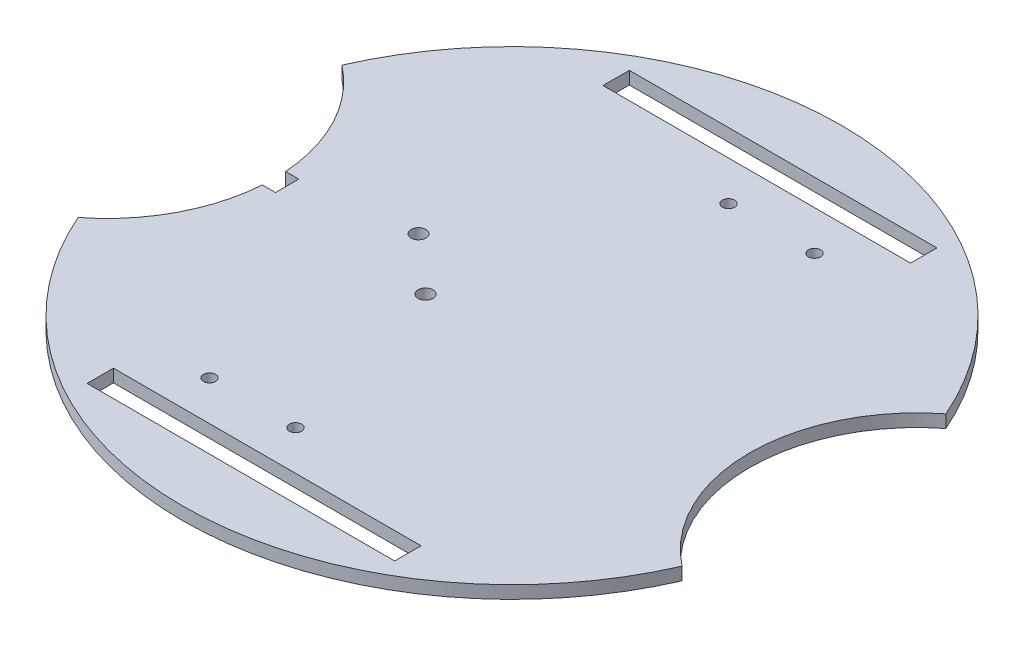
ISO-10303-21;
HEADER;
FILE_DESCRIPTION(('STEP AP214'),'2;1');
FILE_NAME('part.step','',(''),(''),'','','');
FILE_SCHEMA(('AUTOMOTIVE_DESIGN { 1 0 10303 214 1 1 1 1 }'));
ENDSEC;
DATA;
#1=APPLICATION_CONTEXT('core data for automotive mechanical design processes');
#2=APPLICATION_PROTOCOL_DEFINITION('international standard','automotive_design',2000,#1);
#3=PRODUCT_CONTEXT('',#1,'mechanical');
#4=PRODUCT('Part','Part','',(#3));
#5=PRODUCT_RELATED_PRODUCT_CATEGORY('part','',(#4));
#6=PRODUCT_DEFINITION_FORMATION('','',#4);
#7=PRODUCT_DEFINITION_CONTEXT('part definition',#1,'design');
#8=PRODUCT_DEFINITION('design','',#6,#7);
#9=PRODUCT_DEFINITION_SHAPE('','',#8);
#10=(LENGTH_UNIT() NAMED_UNIT(*) SI_UNIT(.MILLI.,.METRE.));
#11=(NAMED_UNIT(*) PLANE_ANGLE_UNIT() SI_UNIT($,.RADIAN.));
#12=(NAMED_UNIT(*) SI_UNIT($,.STERADIAN.) SOLID_ANGLE_UNIT());
#13=UNCERTAINTY_MEASURE_WITH_UNIT(LENGTH_MEASURE(1.E-05),#10,'distance_accuracy_value','');
#14=(GEOMETRIC_REPRESENTATION_CONTEXT(3) GLOBAL_UNCERTAINTY_ASSIGNED_CONTEXT((#13)) GLOBAL_UNIT_ASSIGNED_CONTEXT((#10,
#11,#12)) REPRESENTATION_CONTEXT('',''));
#15=CARTESIAN_POINT('',(0.,0.,0.));
#16=DIRECTION('',(0.,0.,1.));
#17=DIRECTION('',(1.,0.,0.));
#18=AXIS2_PLACEMENT_3D('',#15,#16,#17);
#19=CARTESIAN_POINT('',(0.,2.9,0.));
#20=DIRECTION('',(0.,1.,0.));
#21=DIRECTION('',(0.,0.,1.));
#22=AXIS2_PLACEMENT_3D('',#19,#20,#21);
#23=PLANE('',#22);
#24=DIRECTION('',(1.,0.,0.));
#25=VECTOR('',#24,1.);
#26=CARTESIAN_POINT('',(0.,2.9,-61.7092421050368));
#27=LINE('',#26,#25);
#28=CARTESIAN_POINT('',(-35.,2.9,-61.7092421050368));
#29=VERTEX_POINT('',#28);
#30=CARTESIAN_POINT('',(35.,2.9,-61.7092421050368));
#31=VERTEX_POINT('',#30);
#32=EDGE_CURVE('E183',#29,#31,#27,.T.);
#33=ORIENTED_EDGE('',*,*,#32,.T.);
#34=DIRECTION('',(0.,0.,1.));
#35=VECTOR('',#34,1.);
#36=CARTESIAN_POINT('',(35.,2.9,0.));
#37=LINE('',#36,#35);
#38=CARTESIAN_POINT('',(35.,2.9,-55.7092421050368));
#39=VERTEX_POINT('',#38);
#40=EDGE_CURVE('E57',#31,#39,#37,.T.);
#41=ORIENTED_EDGE('',*,*,#40,.T.);
#42=DIRECTION('',(1.,0.,0.));
#43=VECTOR('',#42,1.);
#44=CARTESIAN_POINT('',(0.,2.9,-55.7092421050368));
#45=LINE('',#44,#43);
#46=CARTESIAN_POINT('',(-35.,2.9,-55.7092421050368));
#47=VERTEX_POINT('',#46);
#48=EDGE_CURVE('E189',#47,#39,#45,.T.);
#49=ORIENTED_EDGE('',*,*,#48,.F.);
#50=DIRECTION('',(0.,0.,1.));
#51=VECTOR('',#50,1.);
#52=CARTESIAN_POINT('',(-34.9999999999999,2.9,0.));
#53=LINE('',#52,#51);
#54=EDGE_CURVE('E186',#29,#47,#53,.T.);
#55=ORIENTED_EDGE('',*,*,#54,.F.);
#56=EDGE_LOOP('',(#33,#41,#49,#55));
#57=FACE_BOUND('',#56,.T.);
#58=CARTESIAN_POINT('',(-22.14,2.9,46.7092421050368));
#59=DIRECTION('',(0.,1.,0.));
#60=DIRECTION('',(0.,0.,1.));
#61=AXIS2_PLACEMENT_3D('',#58,#59,#60);
#62=CIRCLE('',#61,1.4);
#63=CARTESIAN_POINT('',(-22.14,2.9,48.1092421050368));
#64=VERTEX_POINT('',#63);
#65=EDGE_CURVE('E233',#64,#64,#62,.T.);
#66=ORIENTED_EDGE('',*,*,#65,.F.);
#67=EDGE_LOOP('',(#66));
#68=FACE_BOUND('',#67,.T.);
#69=CARTESIAN_POINT('',(-2.56,2.9,46.7092421050368));
#70=DIRECTION('',(0.,1.,0.));
#71=DIRECTION('',(0.,0.,1.));
#72=AXIS2_PLACEMENT_3D('',#69,#70,#71);
#73=CIRCLE('',#72,1.4);
#74=CARTESIAN_POINT('',(-2.56,2.9,48.1092421050368));
#75=VERTEX_POINT('',#74);
#76=EDGE_CURVE('E229',#75,#75,#73,.T.);
#77=ORIENTED_EDGE('',*,*,#76,.F.);
#78=EDGE_LOOP('',(#77));
#79=FACE_BOUND('',#78,.T.);
#80=CARTESIAN_POINT('',(22.14,2.9,-46.7092421050368));
#81=DIRECTION('',(0.,1.,0.));
#82=DIRECTION('',(0.,0.,1.));
#83=AXIS2_PLACEMENT_3D('',#80,#81,#82);
#84=CIRCLE('',#83,1.4);
#85=CARTESIAN_POINT('',(22.14,2.9,-45.3092421050368));
#86=VERTEX_POINT('',#85);
#87=EDGE_CURVE('E225',#86,#86,#84,.T.);
#88=ORIENTED_EDGE('',*,*,#87,.F.);
#89=EDGE_LOOP('',(#88));
#90=FACE_BOUND('',#89,.T.);
#91=CARTESIAN_POINT('',(2.56,2.9,-46.7092421050368));
#92=DIRECTION('',(0.,1.,0.));
#93=DIRECTION('',(0.,0.,1.));
#94=AXIS2_PLACEMENT_3D('',#91,#92,#93);
#95=CIRCLE('',#94,1.4);
#96=CARTESIAN_POINT('',(2.56,2.9,-45.3092421050368));
#97=VERTEX_POINT('',#96);
#98=EDGE_CURVE('E215',#97,#97,#95,.T.);
#99=ORIENTED_EDGE('',*,*,#98,.F.);
#100=EDGE_LOOP('',(#99));
#101=FACE_BOUND('',#100,.T.);
#102=DIRECTION('',(1.,0.,0.));
#103=VECTOR('',#102,1.);
#104=CARTESIAN_POINT('',(0.,2.9,55.7092421050368));
#105=LINE('',#104,#103);
#106=CARTESIAN_POINT('',(-35.,2.9,55.7092421050368));
#107=VERTEX_POINT('',#106);
#108=CARTESIAN_POINT('',(35.,2.9,55.7092421050368));
#109=VERTEX_POINT('',#108);
#110=EDGE_CURVE('E203',#107,#109,#105,.T.);
#111=ORIENTED_EDGE('',*,*,#110,.T.);
#112=DIRECTION('',(0.,0.,1.));
#113=VECTOR('',#112,1.);
#114=CARTESIAN_POINT('',(35.0000000000001,2.9,0.));
#115=LINE('',#114,#113);
#116=CARTESIAN_POINT('',(35.,2.9,61.7092421050368));
#117=VERTEX_POINT('',#116);
#118=EDGE_CURVE('E195',#109,#117,#115,.T.);
#119=ORIENTED_EDGE('',*,*,#118,.T.);
#120=DIRECTION('',(1.,0.,0.));
#121=VECTOR('',#120,1.);
#122=CARTESIAN_POINT('',(0.,2.9,61.7092421050368));
#123=LINE('',#122,#121);
#124=CARTESIAN_POINT('',(-35.,2.9,61.7092421050368));
#125=VERTEX_POINT('',#124);
#126=EDGE_CURVE('E209',#125,#117,#123,.T.);
#127=ORIENTED_EDGE('',*,*,#126,.F.);
#128=DIRECTION('',(0.,0.,1.));
#129=VECTOR('',#128,1.);
#130=CARTESIAN_POINT('',(-35.0000000000001,2.9,0.));
#131=LINE('',#130,#129);
#132=EDGE_CURVE('E206',#107,#125,#131,.T.);
#133=ORIENTED_EDGE('',*,*,#132,.F.);
#134=EDGE_LOOP('',(#111,#119,#127,#133));
#135=FACE_BOUND('',#134,.T.);
#136=CARTESIAN_POINT('',(-26.7852034198443,2.9,-5.5));
#137=DIRECTION('',(0.,1.,0.));
#138=DIRECTION('',(0.,0.,1.));
#139=AXIS2_PLACEMENT_3D('',#136,#137,#138);
#140=CIRCLE('',#139,1.7);
#141=CARTESIAN_POINT('',(-26.7852034198443,2.9,-3.8));
#142=VERTEX_POINT('',#141);
#143=EDGE_CURVE('E178',#142,#142,#140,.T.);
#144=ORIENTED_EDGE('',*,*,#143,.F.);
#145=EDGE_LOOP('',(#144));
#146=FACE_BOUND('',#145,.T.);
#147=CARTESIAN_POINT('',(-14.0852034198443,2.9,5.6));
#148=DIRECTION('',(0.,1.,0.));
#149=DIRECTION('',(0.,0.,1.));
#150=AXIS2_PLACEMENT_3D('',#147,#148,#149);
#151=CIRCLE('',#150,1.7);
#152=CARTESIAN_POINT('',(-14.0852034198443,2.9,7.3));
#153=VERTEX_POINT('',#152);
#154=EDGE_CURVE('E174',#153,#153,#151,.T.);
#155=ORIENTED_EDGE('',*,*,#154,.F.);
#156=EDGE_LOOP('',(#155));
#157=FACE_BOUND('',#156,.T.);
#158=DIRECTION('',(0.,0.,1.));
#159=VECTOR('',#158,1.);
#160=CARTESIAN_POINT('',(-51.1774739428024,2.9,0.));
#161=LINE('',#160,#159);
#162=CARTESIAN_POINT('',(-51.1774739428024,2.9,-2.65));
#163=VERTEX_POINT('',#162);
#164=CARTESIAN_POINT('',(-51.1774739428024,2.9,2.65));
#165=VERTEX_POINT('',#164);
#166=EDGE_CURVE('E152',#163,#165,#161,.T.);
#167=ORIENTED_EDGE('',*,*,#166,.T.);
#168=DIRECTION('',(-1.,0.,0.));
#169=VECTOR('',#168,1.);
#170=CARTESIAN_POINT('',(0.,2.9,2.65000000000003));
#171=LINE('',#170,#169);
#172=CARTESIAN_POINT('',(-54.1774739428024,2.9,2.65));
#173=VERTEX_POINT('',#172);
#174=EDGE_CURVE('E159',#165,#173,#171,.T.);
#175=ORIENTED_EDGE('',*,*,#174,.T.);
#176=CARTESIAN_POINT('',(-92.1852034198443,2.9,0.));
#177=DIRECTION('',(0.,1.,0.));
#178=DIRECTION('',(0.,0.,1.));
#179=AXIS2_PLACEMENT_3D('',#176,#177,#178);
#180=CIRCLE('',#179,38.1);
#181=CARTESIAN_POINT('',(-68.7285012099368,2.9,30.0232097124162));
#182=VERTEX_POINT('',#181);
#183=EDGE_CURVE('E243',#173,#182,#180,.F.);
#184=ORIENTED_EDGE('',*,*,#183,.T.);
#185=CARTESIAN_POINT('',(0.,2.9,0.));
#186=DIRECTION('',(0.,1.,0.));
#187=DIRECTION('',(0.,0.,1.));
#188=AXIS2_PLACEMENT_3D('',#185,#186,#187);
#189=CIRCLE('',#188,75.);
#190=CARTESIAN_POINT('',(68.7285012099368,2.9,30.0232097124162));
#191=VERTEX_POINT('',#190);
#192=EDGE_CURVE('E254',#182,#191,#189,.T.);
#193=ORIENTED_EDGE('',*,*,#192,.T.);
#194=CARTESIAN_POINT('',(92.1852034198443,2.9,0.));
#195=DIRECTION('',(0.,1.,0.));
#196=DIRECTION('',(0.,0.,1.));
#197=AXIS2_PLACEMENT_3D('',#194,#195,#196);
#198=CIRCLE('',#197,38.1);
#199=CARTESIAN_POINT('',(68.7285012099368,2.9,-30.0232097124162));
#200=VERTEX_POINT('',#199);
#201=EDGE_CURVE('E237',#200,#191,#198,.T.);
#202=ORIENTED_EDGE('',*,*,#201,.F.);
#203=CARTESIAN_POINT('',(-68.7285012099368,2.9,-30.0232097124162));
#204=VERTEX_POINT('',#203);
#205=EDGE_CURVE('E258',#200,#204,#189,.T.);
#206=ORIENTED_EDGE('',*,*,#205,.T.);
#207=CARTESIAN_POINT('',(-54.1774739428024,2.9,-2.65));
#208=VERTEX_POINT('',#207);
#209=EDGE_CURVE('E245',#204,#208,#180,.F.);
#210=ORIENTED_EDGE('',*,*,#209,.T.);
#211=DIRECTION('',(1.,0.,0.));
#212=VECTOR('',#211,1.);
#213=CARTESIAN_POINT('',(0.,2.9,-2.65000000000003));
#214=LINE('',#213,#212);
#215=EDGE_CURVE('E49',#208,#163,#214,.T.);
#216=ORIENTED_EDGE('',*,*,#215,.T.);
#217=EDGE_LOOP('',(#167,#175,#184,#193,#202,#206,#210,#216));
#218=FACE_BOUND('',#217,.T.);
#219=ADVANCED_FACE('F34',(#57,#68,#79,#90,#101,#135,#146,#157,#218),#23,.T.);
#220=CARTESIAN_POINT('',(0.,0.,0.));
#221=DIRECTION('',(0.,1.,0.));
#222=DIRECTION('',(0.,0.,1.));
#223=AXIS2_PLACEMENT_3D('',#220,#221,#222);
#224=PLANE('',#223);
#225=DIRECTION('',(0.,0.,1.));
#226=VECTOR('',#225,1.);
#227=CARTESIAN_POINT('',(35.,0.,0.));
#228=LINE('',#227,#226);
#229=CARTESIAN_POINT('',(35.,0.,-61.7092421050368));
#230=VERTEX_POINT('',#229);
#231=CARTESIAN_POINT('',(35.,0.,-55.7092421050368));
#232=VERTEX_POINT('',#231);
#233=EDGE_CURVE('E294',#230,#232,#228,.T.);
#234=ORIENTED_EDGE('',*,*,#233,.F.);
#235=DIRECTION('',(1.,0.,0.));
#236=VECTOR('',#235,1.);
#237=CARTESIAN_POINT('',(0.,0.,-61.7092421050368));
#238=LINE('',#237,#236);
#239=CARTESIAN_POINT('',(-35.,0.,-61.7092421050368));
#240=VERTEX_POINT('',#239);
#241=EDGE_CURVE('E286',#240,#230,#238,.T.);
#242=ORIENTED_EDGE('',*,*,#241,.F.);
#243=DIRECTION('',(0.,0.,1.));
#244=VECTOR('',#243,1.);
#245=CARTESIAN_POINT('',(-34.9999999999999,0.,0.));
#246=LINE('',#245,#244);
#247=CARTESIAN_POINT('',(-35.,0.,-55.7092421050368));
#248=VERTEX_POINT('',#247);
#249=EDGE_CURVE('E288',#240,#248,#246,.T.);
#250=ORIENTED_EDGE('',*,*,#249,.T.);
#251=DIRECTION('',(1.,0.,0.));
#252=VECTOR('',#251,1.);
#253=CARTESIAN_POINT('',(0.,0.,-55.7092421050368));
#254=LINE('',#253,#252);
#255=EDGE_CURVE('E291',#248,#232,#254,.T.);
#256=ORIENTED_EDGE('',*,*,#255,.T.);
#257=EDGE_LOOP('',(#234,#242,#250,#256));
#258=FACE_BOUND('',#257,.T.);
#259=CARTESIAN_POINT('',(-22.14,0.,46.7092421050368));
#260=DIRECTION('',(0.,1.,0.));
#261=DIRECTION('',(0.,0.,1.));
#262=AXIS2_PLACEMENT_3D('',#259,#260,#261);
#263=CIRCLE('',#262,1.4);
#264=CARTESIAN_POINT('',(-22.14,0.,48.1092421050368));
#265=VERTEX_POINT('',#264);
#266=EDGE_CURVE('E236',#265,#265,#263,.T.);
#267=ORIENTED_EDGE('',*,*,#266,.T.);
#268=EDGE_LOOP('',(#267));
#269=FACE_BOUND('',#268,.T.);
#270=CARTESIAN_POINT('',(-2.56,0.,46.7092421050368));
#271=DIRECTION('',(0.,1.,0.));
#272=DIRECTION('',(0.,0.,1.));
#273=AXIS2_PLACEMENT_3D('',#270,#271,#272);
#274=CIRCLE('',#273,1.4);
#275=CARTESIAN_POINT('',(-2.56,0.,48.1092421050368));
#276=VERTEX_POINT('',#275);
#277=EDGE_CURVE('E232',#276,#276,#274,.T.);
#278=ORIENTED_EDGE('',*,*,#277,.T.);
#279=EDGE_LOOP('',(#278));
#280=FACE_BOUND('',#279,.T.);
#281=CARTESIAN_POINT('',(22.14,0.,-46.7092421050368));
#282=DIRECTION('',(0.,1.,0.));
#283=DIRECTION('',(0.,0.,1.));
#284=AXIS2_PLACEMENT_3D('',#281,#282,#283);
#285=CIRCLE('',#284,1.4);
#286=CARTESIAN_POINT('',(22.14,0.,-45.3092421050368));
#287=VERTEX_POINT('',#286);
#288=EDGE_CURVE('E228',#287,#287,#285,.T.);
#289=ORIENTED_EDGE('',*,*,#288,.T.);
#290=EDGE_LOOP('',(#289));
#291=FACE_BOUND('',#290,.T.);
#292=CARTESIAN_POINT('',(2.56,0.,-46.7092421050368));
#293=DIRECTION('',(0.,1.,0.));
#294=DIRECTION('',(0.,0.,1.));
#295=AXIS2_PLACEMENT_3D('',#292,#293,#294);
#296=CIRCLE('',#295,1.4);
#297=CARTESIAN_POINT('',(2.56,0.,-45.3092421050368));
#298=VERTEX_POINT('',#297);
#299=EDGE_CURVE('E224',#298,#298,#296,.T.);
#300=ORIENTED_EDGE('',*,*,#299,.T.);
#301=EDGE_LOOP('',(#300));
#302=FACE_BOUND('',#301,.T.);
#303=DIRECTION('',(0.,0.,1.));
#304=VECTOR('',#303,1.);
#305=CARTESIAN_POINT('',(35.0000000000001,0.,0.));
#306=LINE('',#305,#304);
#307=CARTESIAN_POINT('',(35.,0.,55.7092421050368));
#308=VERTEX_POINT('',#307);
#309=CARTESIAN_POINT('',(35.,0.,61.7092421050368));
#310=VERTEX_POINT('',#309);
#311=EDGE_CURVE('E284',#308,#310,#306,.T.);
#312=ORIENTED_EDGE('',*,*,#311,.F.);
#313=DIRECTION('',(1.,0.,0.));
#314=VECTOR('',#313,1.);
#315=CARTESIAN_POINT('',(0.,0.,55.7092421050368));
#316=LINE('',#315,#314);
#317=CARTESIAN_POINT('',(-35.,0.,55.7092421050368));
#318=VERTEX_POINT('',#317);
#319=EDGE_CURVE('E268',#318,#308,#316,.T.);
#320=ORIENTED_EDGE('',*,*,#319,.F.);
#321=DIRECTION('',(0.,0.,1.));
#322=VECTOR('',#321,1.);
#323=CARTESIAN_POINT('',(-35.0000000000001,0.,0.));
#324=LINE('',#323,#322);
#325=CARTESIAN_POINT('',(-35.,0.,61.7092421050368));
#326=VERTEX_POINT('',#325);
#327=EDGE_CURVE('E278',#318,#326,#324,.T.);
#328=ORIENTED_EDGE('',*,*,#327,.T.);
#329=DIRECTION('',(1.,0.,0.));
#330=VECTOR('',#329,1.);
#331=CARTESIAN_POINT('',(0.,0.,61.7092421050368));
#332=LINE('',#331,#330);
#333=EDGE_CURVE('E281',#326,#310,#332,.T.);
#334=ORIENTED_EDGE('',*,*,#333,.T.);
#335=EDGE_LOOP('',(#312,#320,#328,#334));
#336=FACE_BOUND('',#335,.T.);
#337=CARTESIAN_POINT('',(-26.7852034198443,0.,-5.5));
#338=DIRECTION('',(0.,1.,0.));
#339=DIRECTION('',(0.,0.,1.));
#340=AXIS2_PLACEMENT_3D('',#337,#338,#339);
#341=CIRCLE('',#340,1.7);
#342=CARTESIAN_POINT('',(-26.7852034198443,0.,-3.8));
#343=VERTEX_POINT('',#342);
#344=EDGE_CURVE('E181',#343,#343,#341,.T.);
#345=ORIENTED_EDGE('',*,*,#344,.T.);
#346=EDGE_LOOP('',(#345));
#347=FACE_BOUND('',#346,.T.);
#348=CARTESIAN_POINT('',(-14.0852034198443,0.,5.6));
#349=DIRECTION('',(0.,1.,0.));
#350=DIRECTION('',(0.,0.,1.));
#351=AXIS2_PLACEMENT_3D('',#348,#349,#350);
#352=CIRCLE('',#351,1.7);
#353=CARTESIAN_POINT('',(-14.0852034198443,0.,7.3));
#354=VERTEX_POINT('',#353);
#355=EDGE_CURVE('E177',#354,#354,#352,.T.);
#356=ORIENTED_EDGE('',*,*,#355,.T.);
#357=EDGE_LOOP('',(#356));
#358=FACE_BOUND('',#357,.T.);
#359=DIRECTION('',(-1.,0.,0.));
#360=VECTOR('',#359,1.);
#361=CARTESIAN_POINT('',(0.,0.,2.65000000000003));
#362=LINE('',#361,#360);
#363=CARTESIAN_POINT('',(-51.1774739428024,0.,2.65));
#364=VERTEX_POINT('',#363);
#365=CARTESIAN_POINT('',(-54.1774739428024,0.,2.65));
#366=VERTEX_POINT('',#365);
#367=EDGE_CURVE('E172',#364,#366,#362,.T.);
#368=ORIENTED_EDGE('',*,*,#367,.F.);
#369=DIRECTION('',(0.,0.,1.));
#370=VECTOR('',#369,1.);
#371=CARTESIAN_POINT('',(-51.1774739428024,0.,0.));
#372=LINE('',#371,#370);
#373=CARTESIAN_POINT('',(-51.1774739428024,0.,-2.65));
#374=VERTEX_POINT('',#373);
#375=EDGE_CURVE('E11',#374,#364,#372,.T.);
#376=ORIENTED_EDGE('',*,*,#375,.F.);
#377=DIRECTION('',(1.,0.,0.));
#378=VECTOR('',#377,1.);
#379=CARTESIAN_POINT('',(0.,0.,-2.65000000000003));
#380=LINE('',#379,#378);
#381=CARTESIAN_POINT('',(-54.1774739428024,0.,-2.65));
#382=VERTEX_POINT('',#381);
#383=EDGE_CURVE('E169',#382,#374,#380,.T.);
#384=ORIENTED_EDGE('',*,*,#383,.F.);
#385=CARTESIAN_POINT('',(-92.1852034198443,0.,0.));
#386=DIRECTION('',(0.,1.,0.));
#387=DIRECTION('',(0.,0.,1.));
#388=AXIS2_PLACEMENT_3D('',#385,#386,#387);
#389=CIRCLE('',#388,38.1);
#390=CARTESIAN_POINT('',(-68.7285012099368,0.,-30.0232097124162));
#391=VERTEX_POINT('',#390);
#392=EDGE_CURVE('E262',#391,#382,#389,.F.);
#393=ORIENTED_EDGE('',*,*,#392,.F.);
#394=CARTESIAN_POINT('',(0.,0.,0.));
#395=DIRECTION('',(0.,1.,0.));
#396=DIRECTION('',(0.,0.,1.));
#397=AXIS2_PLACEMENT_3D('',#394,#395,#396);
#398=CIRCLE('',#397,75.);
#399=CARTESIAN_POINT('',(68.7285012099368,0.,-30.0232097124162));
#400=VERTEX_POINT('',#399);
#401=EDGE_CURVE('E251',#400,#391,#398,.T.);
#402=ORIENTED_EDGE('',*,*,#401,.F.);
#403=CARTESIAN_POINT('',(92.1852034198443,0.,0.));
#404=DIRECTION('',(0.,1.,0.));
#405=DIRECTION('',(0.,0.,1.));
#406=AXIS2_PLACEMENT_3D('',#403,#404,#405);
#407=CIRCLE('',#406,38.1);
#408=CARTESIAN_POINT('',(68.7285012099368,0.,30.0232097124162));
#409=VERTEX_POINT('',#408);
#410=EDGE_CURVE('E265',#400,#409,#407,.T.);
#411=ORIENTED_EDGE('',*,*,#410,.T.);
#412=CARTESIAN_POINT('',(-68.7285012099368,0.,30.0232097124162));
#413=VERTEX_POINT('',#412);
#414=EDGE_CURVE('E259',#413,#409,#398,.T.);
#415=ORIENTED_EDGE('',*,*,#414,.F.);
#416=EDGE_CURVE('E257',#366,#413,#389,.F.);
#417=ORIENTED_EDGE('',*,*,#416,.F.);
#418=EDGE_LOOP('',(#368,#376,#384,#393,#402,#411,#415,#417));
#419=FACE_BOUND('',#418,.T.);
#420=ADVANCED_FACE('F307',(#258,#269,#280,#291,#302,#336,#347,#358,#419),#224,.F.);
#421=CARTESIAN_POINT('',(-92.1852034198443,-7.1,0.));
#422=DIRECTION('',(0.,1.,0.));
#423=DIRECTION('',(0.,0.,1.));
#424=AXIS2_PLACEMENT_3D('',#421,#422,#423);
#425=CYLINDRICAL_SURFACE('',#424,38.1);
#426=ORIENTED_EDGE('',*,*,#183,.F.);
#427=DIRECTION('',(0.,1.,0.));
#428=VECTOR('',#427,1.);
#429=CARTESIAN_POINT('',(-54.1774739428024,-7.1,2.65));
#430=LINE('',#429,#428);
#431=EDGE_CURVE('E42',#173,#366,#430,.F.);
#432=ORIENTED_EDGE('',*,*,#431,.T.);
#433=ORIENTED_EDGE('',*,*,#416,.T.);
#434=DIRECTION('',(0.,1.,0.));
#435=VECTOR('',#434,1.);
#436=CARTESIAN_POINT('',(-68.7285012099368,-7.1,30.0232097124162));
#437=LINE('',#436,#435);
#438=EDGE_CURVE('E248',#413,#182,#437,.T.);
#439=ORIENTED_EDGE('',*,*,#438,.T.);
#440=EDGE_LOOP('',(#426,#432,#433,#439));
#441=FACE_BOUND('',#440,.T.);
#442=ADVANCED_FACE('F303',(#441),#425,.F.);
#443=ORIENTED_EDGE('',*,*,#392,.T.);
#444=DIRECTION('',(0.,1.,0.));
#445=VECTOR('',#444,1.);
#446=CARTESIAN_POINT('',(-54.1774739428024,-7.1,-2.65));
#447=LINE('',#446,#445);
#448=EDGE_CURVE('E296',#382,#208,#447,.T.);
#449=ORIENTED_EDGE('',*,*,#448,.T.);
#450=ORIENTED_EDGE('',*,*,#209,.F.);
#451=DIRECTION('',(0.,1.,0.));
#452=VECTOR('',#451,1.);
#453=CARTESIAN_POINT('',(-68.7285012099368,-7.1,-30.0232097124162));
#454=LINE('',#453,#452);
#455=EDGE_CURVE('E247',#391,#204,#454,.T.);
#456=ORIENTED_EDGE('',*,*,#455,.F.);
#457=EDGE_LOOP('',(#443,#449,#450,#456));
#458=FACE_BOUND('',#457,.T.);
#459=ADVANCED_FACE('F321',(#458),#425,.F.);
#460=CARTESIAN_POINT('',(0.,2.9,0.));
#461=DIRECTION('',(0.,-1.,0.));
#462=DIRECTION('',(0.,0.,-1.));
#463=AXIS2_PLACEMENT_3D('',#460,#461,#462);
#464=CYLINDRICAL_SURFACE('',#463,75.);
#465=ORIENTED_EDGE('',*,*,#414,.T.);
#466=DIRECTION('',(0.,1.,0.));
#467=VECTOR('',#466,1.);
#468=CARTESIAN_POINT('',(68.7285012099368,-7.1,30.0232097124162));
#469=LINE('',#468,#467);
#470=EDGE_CURVE('E240',#409,#191,#469,.T.);
#471=ORIENTED_EDGE('',*,*,#470,.T.);
#472=ORIENTED_EDGE('',*,*,#192,.F.);
#473=ORIENTED_EDGE('',*,*,#438,.F.);
#474=EDGE_LOOP('',(#465,#471,#472,#473));
#475=FACE_BOUND('',#474,.T.);
#476=ADVANCED_FACE('F310',(#475),#464,.T.);
#477=ORIENTED_EDGE('',*,*,#205,.F.);
#478=DIRECTION('',(0.,1.,0.));
#479=VECTOR('',#478,1.);
#480=CARTESIAN_POINT('',(68.7285012099368,-7.1,-30.0232097124162));
#481=LINE('',#480,#479);
#482=EDGE_CURVE('E239',#400,#200,#481,.T.);
#483=ORIENTED_EDGE('',*,*,#482,.F.);
#484=ORIENTED_EDGE('',*,*,#401,.T.);
#485=ORIENTED_EDGE('',*,*,#455,.T.);
#486=EDGE_LOOP('',(#477,#483,#484,#485));
#487=FACE_BOUND('',#486,.T.);
#488=ADVANCED_FACE('F36',(#487),#464,.T.);
#489=CARTESIAN_POINT('',(92.1852034198443,-7.1,0.));
#490=DIRECTION('',(0.,1.,0.));
#491=DIRECTION('',(0.,0.,1.));
#492=AXIS2_PLACEMENT_3D('',#489,#490,#491);
#493=CYLINDRICAL_SURFACE('',#492,38.1);
#494=ORIENTED_EDGE('',*,*,#482,.T.);
#495=ORIENTED_EDGE('',*,*,#201,.T.);
#496=ORIENTED_EDGE('',*,*,#470,.F.);
#497=ORIENTED_EDGE('',*,*,#410,.F.);
#498=EDGE_LOOP('',(#494,#495,#496,#497));
#499=FACE_BOUND('',#498,.T.);
#500=ADVANCED_FACE('F342',(#499),#493,.F.);
#501=CARTESIAN_POINT('',(-22.14,-7.1,46.7092421050368));
#502=DIRECTION('',(0.,1.,0.));
#503=DIRECTION('',(0.,0.,1.));
#504=AXIS2_PLACEMENT_3D('',#501,#502,#503);
#505=CYLINDRICAL_SURFACE('',#504,1.4);
#506=ORIENTED_EDGE('',*,*,#65,.T.);
#507=EDGE_LOOP('',(#506));
#508=FACE_BOUND('',#507,.T.);
#509=ORIENTED_EDGE('',*,*,#266,.F.);
#510=EDGE_LOOP('',(#509));
#511=FACE_BOUND('',#510,.T.);
#512=ADVANCED_FACE('F345',(#508,#511),#505,.F.);
#513=CARTESIAN_POINT('',(-2.56,-7.1,46.7092421050368));
#514=DIRECTION('',(0.,1.,0.));
#515=DIRECTION('',(0.,0.,1.));
#516=AXIS2_PLACEMENT_3D('',#513,#514,#515);
#517=CYLINDRICAL_SURFACE('',#516,1.4);
#518=ORIENTED_EDGE('',*,*,#76,.T.);
#519=EDGE_LOOP('',(#518));
#520=FACE_BOUND('',#519,.T.);
#521=ORIENTED_EDGE('',*,*,#277,.F.);
#522=EDGE_LOOP('',(#521));
#523=FACE_BOUND('',#522,.T.);
#524=ADVANCED_FACE('F348',(#520,#523),#517,.F.);
#525=CARTESIAN_POINT('',(22.14,-7.1,-46.7092421050368));
#526=DIRECTION('',(0.,1.,0.));
#527=DIRECTION('',(0.,0.,1.));
#528=AXIS2_PLACEMENT_3D('',#525,#526,#527);
#529=CYLINDRICAL_SURFACE('',#528,1.4);
#530=ORIENTED_EDGE('',*,*,#87,.T.);
#531=EDGE_LOOP('',(#530));
#532=FACE_BOUND('',#531,.T.);
#533=ORIENTED_EDGE('',*,*,#288,.F.);
#534=EDGE_LOOP('',(#533));
#535=FACE_BOUND('',#534,.T.);
#536=ADVANCED_FACE('F352',(#532,#535),#529,.F.);
#537=CARTESIAN_POINT('',(2.56,-7.1,-46.7092421050368));
#538=DIRECTION('',(0.,1.,0.));
#539=DIRECTION('',(0.,0.,1.));
#540=AXIS2_PLACEMENT_3D('',#537,#538,#539);
#541=CYLINDRICAL_SURFACE('',#540,1.4);
#542=ORIENTED_EDGE('',*,*,#98,.T.);
#543=EDGE_LOOP('',(#542));
#544=FACE_BOUND('',#543,.T.);
#545=ORIENTED_EDGE('',*,*,#299,.F.);
#546=EDGE_LOOP('',(#545));
#547=FACE_BOUND('',#546,.T.);
#548=ADVANCED_FACE('F356',(#544,#547),#541,.F.);
#549=CARTESIAN_POINT('',(35.0000000000001,-7.1,0.));
#550=DIRECTION('',(-1.,0.,0.));
#551=DIRECTION('',(0.,0.,1.));
#552=AXIS2_PLACEMENT_3D('',#549,#550,#551);
#553=PLANE('',#552);
#554=ORIENTED_EDGE('',*,*,#311,.T.);
#555=DIRECTION('',(0.,1.,0.));
#556=VECTOR('',#555,1.);
#557=CARTESIAN_POINT('',(35.,-7.1,61.7092421050368));
#558=LINE('',#557,#556);
#559=EDGE_CURVE('E213',#310,#117,#558,.T.);
#560=ORIENTED_EDGE('',*,*,#559,.T.);
#561=ORIENTED_EDGE('',*,*,#118,.F.);
#562=DIRECTION('',(0.,1.,0.));
#563=VECTOR('',#562,1.);
#564=CARTESIAN_POINT('',(35.,-7.1,55.7092421050368));
#565=LINE('',#564,#563);
#566=EDGE_CURVE('E212',#308,#109,#565,.T.);
#567=ORIENTED_EDGE('',*,*,#566,.F.);
#568=EDGE_LOOP('',(#554,#560,#561,#567));
#569=FACE_BOUND('',#568,.T.);
#570=ADVANCED_FACE('F360',(#569),#553,.T.);
#571=CARTESIAN_POINT('',(0.,-7.1,61.7092421050368));
#572=DIRECTION('',(0.,0.,1.));
#573=DIRECTION('',(1.,0.,0.));
#574=AXIS2_PLACEMENT_3D('',#571,#572,#573);
#575=PLANE('',#574);
#576=DIRECTION('',(0.,1.,0.));
#577=VECTOR('',#576,1.);
#578=CARTESIAN_POINT('',(-35.,-7.1,61.7092421050368));
#579=LINE('',#578,#577);
#580=EDGE_CURVE('E216',#326,#125,#579,.T.);
#581=ORIENTED_EDGE('',*,*,#580,.T.);
#582=ORIENTED_EDGE('',*,*,#126,.T.);
#583=ORIENTED_EDGE('',*,*,#559,.F.);
#584=ORIENTED_EDGE('',*,*,#333,.F.);
#585=EDGE_LOOP('',(#581,#582,#583,#584));
#586=FACE_BOUND('',#585,.T.);
#587=ADVANCED_FACE('F364',(#586),#575,.F.);
#588=CARTESIAN_POINT('',(-35.0000000000001,-7.1,0.));
#589=DIRECTION('',(-1.,0.,0.));
#590=DIRECTION('',(0.,0.,1.));
#591=AXIS2_PLACEMENT_3D('',#588,#589,#590);
#592=PLANE('',#591);
#593=DIRECTION('',(0.,1.,0.));
#594=VECTOR('',#593,1.);
#595=CARTESIAN_POINT('',(-35.,-7.1,55.7092421050368));
#596=LINE('',#595,#594);
#597=EDGE_CURVE('E218',#318,#107,#596,.T.);
#598=ORIENTED_EDGE('',*,*,#597,.T.);
#599=ORIENTED_EDGE('',*,*,#132,.T.);
#600=ORIENTED_EDGE('',*,*,#580,.F.);
#601=ORIENTED_EDGE('',*,*,#327,.F.);
#602=EDGE_LOOP('',(#598,#599,#600,#601));
#603=FACE_BOUND('',#602,.T.);
#604=ADVANCED_FACE('F370',(#603),#592,.F.);
#605=CARTESIAN_POINT('',(0.,-7.1,55.7092421050368));
#606=DIRECTION('',(0.,0.,1.));
#607=DIRECTION('',(1.,0.,0.));
#608=AXIS2_PLACEMENT_3D('',#605,#606,#607);
#609=PLANE('',#608);
#610=ORIENTED_EDGE('',*,*,#319,.T.);
#611=ORIENTED_EDGE('',*,*,#566,.T.);
#612=ORIENTED_EDGE('',*,*,#110,.F.);
#613=ORIENTED_EDGE('',*,*,#597,.F.);
#614=EDGE_LOOP('',(#610,#611,#612,#613));
#615=FACE_BOUND('',#614,.T.);
#616=ADVANCED_FACE('F366',(#615),#609,.T.);
#617=CARTESIAN_POINT('',(35.,-7.1,0.));
#618=DIRECTION('',(-1.,0.,0.));
#619=DIRECTION('',(0.,0.,1.));
#620=AXIS2_PLACEMENT_3D('',#617,#618,#619);
#621=PLANE('',#620);
#622=ORIENTED_EDGE('',*,*,#233,.T.);
#623=DIRECTION('',(0.,1.,0.));
#624=VECTOR('',#623,1.);
#625=CARTESIAN_POINT('',(35.,-7.1,-55.7092421050368));
#626=LINE('',#625,#624);
#627=EDGE_CURVE('E193',#232,#39,#626,.T.);
#628=ORIENTED_EDGE('',*,*,#627,.T.);
#629=ORIENTED_EDGE('',*,*,#40,.F.);
#630=DIRECTION('',(0.,1.,0.));
#631=VECTOR('',#630,1.);
#632=CARTESIAN_POINT('',(35.,-7.1,-61.7092421050368));
#633=LINE('',#632,#631);
#634=EDGE_CURVE('E192',#230,#31,#633,.T.);
#635=ORIENTED_EDGE('',*,*,#634,.F.);
#636=EDGE_LOOP('',(#622,#628,#629,#635));
#637=FACE_BOUND('',#636,.T.);
#638=ADVANCED_FACE('F369',(#637),#621,.T.);
#639=CARTESIAN_POINT('',(0.,-7.1,-55.7092421050368));
#640=DIRECTION('',(0.,0.,1.));
#641=DIRECTION('',(1.,0.,0.));
#642=AXIS2_PLACEMENT_3D('',#639,#640,#641);
#643=PLANE('',#642);
#644=DIRECTION('',(0.,1.,0.));
#645=VECTOR('',#644,1.);
#646=CARTESIAN_POINT('',(-35.,-7.1,-55.7092421050368));
#647=LINE('',#646,#645);
#648=EDGE_CURVE('E196',#248,#47,#647,.T.);
#649=ORIENTED_EDGE('',*,*,#648,.T.);
#650=ORIENTED_EDGE('',*,*,#48,.T.);
#651=ORIENTED_EDGE('',*,*,#627,.F.);
#652=ORIENTED_EDGE('',*,*,#255,.F.);
#653=EDGE_LOOP('',(#649,#650,#651,#652));
#654=FACE_BOUND('',#653,.T.);
#655=ADVANCED_FACE('F380',(#654),#643,.F.);
#656=CARTESIAN_POINT('',(-34.9999999999999,-7.1,0.));
#657=DIRECTION('',(-1.,0.,0.));
#658=DIRECTION('',(0.,0.,1.));
#659=AXIS2_PLACEMENT_3D('',#656,#657,#658);
#660=PLANE('',#659);
#661=DIRECTION('',(0.,1.,0.));
#662=VECTOR('',#661,1.);
#663=CARTESIAN_POINT('',(-35.,-7.1,-61.7092421050368));
#664=LINE('',#663,#662);
#665=EDGE_CURVE('E198',#240,#29,#664,.T.);
#666=ORIENTED_EDGE('',*,*,#665,.T.);
#667=ORIENTED_EDGE('',*,*,#54,.T.);
#668=ORIENTED_EDGE('',*,*,#648,.F.);
#669=ORIENTED_EDGE('',*,*,#249,.F.);
#670=EDGE_LOOP('',(#666,#667,#668,#669));
#671=FACE_BOUND('',#670,.T.);
#672=ADVANCED_FACE('F385',(#671),#660,.F.);
#673=CARTESIAN_POINT('',(0.,-7.1,-61.7092421050368));
#674=DIRECTION('',(0.,0.,1.));
#675=DIRECTION('',(1.,0.,0.));
#676=AXIS2_PLACEMENT_3D('',#673,#674,#675);
#677=PLANE('',#676);
#678=ORIENTED_EDGE('',*,*,#241,.T.);
#679=ORIENTED_EDGE('',*,*,#634,.T.);
#680=ORIENTED_EDGE('',*,*,#32,.F.);
#681=ORIENTED_EDGE('',*,*,#665,.F.);
#682=EDGE_LOOP('',(#678,#679,#680,#681));
#683=FACE_BOUND('',#682,.T.);
#684=ADVANCED_FACE('F381',(#683),#677,.T.);
#685=CARTESIAN_POINT('',(-26.7852034198443,-7.1,-5.5));
#686=DIRECTION('',(0.,1.,0.));
#687=DIRECTION('',(0.,0.,1.));
#688=AXIS2_PLACEMENT_3D('',#685,#686,#687);
#689=CYLINDRICAL_SURFACE('',#688,1.7);
#690=ORIENTED_EDGE('',*,*,#143,.T.);
#691=EDGE_LOOP('',(#690));
#692=FACE_BOUND('',#691,.T.);
#693=ORIENTED_EDGE('',*,*,#344,.F.);
#694=EDGE_LOOP('',(#693));
#695=FACE_BOUND('',#694,.T.);
#696=ADVANCED_FACE('F384',(#692,#695),#689,.F.);
#697=CARTESIAN_POINT('',(-14.0852034198443,-7.1,5.6));
#698=DIRECTION('',(0.,1.,0.));
#699=DIRECTION('',(0.,0.,1.));
#700=AXIS2_PLACEMENT_3D('',#697,#698,#699);
#701=CYLINDRICAL_SURFACE('',#700,1.7);
#702=ORIENTED_EDGE('',*,*,#154,.T.);
#703=EDGE_LOOP('',(#702));
#704=FACE_BOUND('',#703,.T.);
#705=ORIENTED_EDGE('',*,*,#355,.F.);
#706=EDGE_LOOP('',(#705));
#707=FACE_BOUND('',#706,.T.);
#708=ADVANCED_FACE('F395',(#704,#707),#701,.F.);
#709=CARTESIAN_POINT('',(-51.1774739428024,-7.1,0.));
#710=DIRECTION('',(-1.,0.,0.));
#711=DIRECTION('',(0.,0.,1.));
#712=AXIS2_PLACEMENT_3D('',#709,#710,#711);
#713=PLANE('',#712);
#714=ORIENTED_EDGE('',*,*,#375,.T.);
#715=DIRECTION('',(0.,1.,0.));
#716=VECTOR('',#715,1.);
#717=CARTESIAN_POINT('',(-51.1774739428024,-7.1,2.65));
#718=LINE('',#717,#716);
#719=EDGE_CURVE('E147',#364,#165,#718,.T.);
#720=ORIENTED_EDGE('',*,*,#719,.T.);
#721=ORIENTED_EDGE('',*,*,#166,.F.);
#722=DIRECTION('',(0.,1.,0.));
#723=VECTOR('',#722,1.);
#724=CARTESIAN_POINT('',(-51.1774739428024,-7.1,-2.65));
#725=LINE('',#724,#723);
#726=EDGE_CURVE('E156',#374,#163,#725,.T.);
#727=ORIENTED_EDGE('',*,*,#726,.F.);
#728=EDGE_LOOP('',(#714,#720,#721,#727));
#729=FACE_BOUND('',#728,.T.);
#730=ADVANCED_FACE('F149',(#729),#713,.T.);
#731=CARTESIAN_POINT('',(0.,-7.1,2.65000000000003));
#732=DIRECTION('',(0.,0.,-1.));
#733=DIRECTION('',(-1.,0.,0.));
#734=AXIS2_PLACEMENT_3D('',#731,#732,#733);
#735=PLANE('',#734);
#736=ORIENTED_EDGE('',*,*,#367,.T.);
#737=ORIENTED_EDGE('',*,*,#431,.F.);
#738=ORIENTED_EDGE('',*,*,#174,.F.);
#739=ORIENTED_EDGE('',*,*,#719,.F.);
#740=EDGE_LOOP('',(#736,#737,#738,#739));
#741=FACE_BOUND('',#740,.T.);
#742=ADVANCED_FACE('F160',(#741),#735,.T.);
#743=CARTESIAN_POINT('',(0.,-7.1,-2.65000000000003));
#744=DIRECTION('',(0.,0.,1.));
#745=DIRECTION('',(1.,0.,0.));
#746=AXIS2_PLACEMENT_3D('',#743,#744,#745);
#747=PLANE('',#746);
#748=ORIENTED_EDGE('',*,*,#383,.T.);
#749=ORIENTED_EDGE('',*,*,#726,.T.);
#750=ORIENTED_EDGE('',*,*,#215,.F.);
#751=ORIENTED_EDGE('',*,*,#448,.F.);
#752=EDGE_LOOP('',(#748,#749,#750,#751));
#753=FACE_BOUND('',#752,.T.);
#754=ADVANCED_FACE('F323',(#753),#747,.T.);
#755=CLOSED_SHELL('',(#219,#420,#442,#459,#476,#488,#500,#512,#524,#536,#548,#570,#587,#604,
#616,#638,#655,#672,#684,#696,#708,#730,#742,#754));
#756=MANIFOLD_SOLID_BREP('B2',#755);
#757=ADVANCED_BREP_SHAPE_REPRESENTATION('',(#18,#756),#14);
#758=SHAPE_DEFINITION_REPRESENTATION(#9,#757);
ENDSEC;
END-ISO-10303-21;
